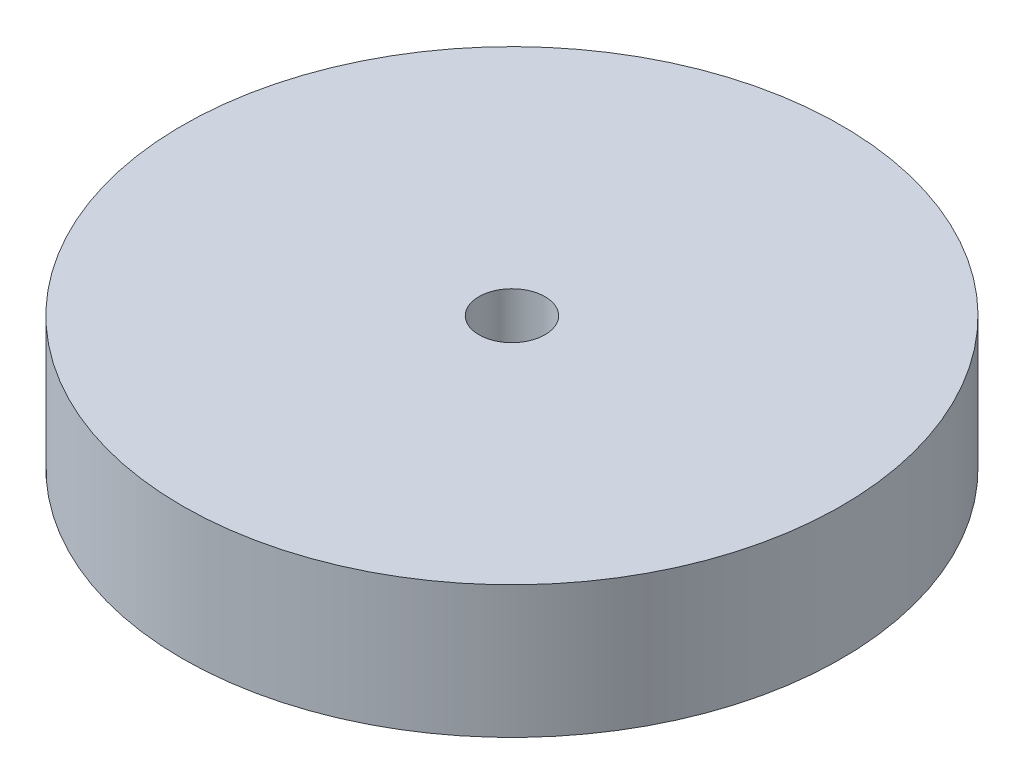
ISO-10303-21;
HEADER;
FILE_DESCRIPTION(('STEP AP214'),'2;1');
FILE_NAME('part.step','',(''),(''),'','','');
FILE_SCHEMA(('AUTOMOTIVE_DESIGN { 1 0 10303 214 1 1 1 1 }'));
ENDSEC;
DATA;
#1=APPLICATION_CONTEXT('core data for automotive mechanical design processes');
#2=APPLICATION_PROTOCOL_DEFINITION('international standard','automotive_design',2000,#1);
#3=PRODUCT_CONTEXT('',#1,'mechanical');
#4=PRODUCT('Part','Part','',(#3));
#5=PRODUCT_RELATED_PRODUCT_CATEGORY('part','',(#4));
#6=PRODUCT_DEFINITION_FORMATION('','',#4);
#7=PRODUCT_DEFINITION_CONTEXT('part definition',#1,'design');
#8=PRODUCT_DEFINITION('design','',#6,#7);
#9=PRODUCT_DEFINITION_SHAPE('','',#8);
#10=(LENGTH_UNIT() NAMED_UNIT(*) SI_UNIT(.MILLI.,.METRE.));
#11=(NAMED_UNIT(*) PLANE_ANGLE_UNIT() SI_UNIT($,.RADIAN.));
#12=(NAMED_UNIT(*) SI_UNIT($,.STERADIAN.) SOLID_ANGLE_UNIT());
#13=UNCERTAINTY_MEASURE_WITH_UNIT(LENGTH_MEASURE(1.E-05),#10,'distance_accuracy_value','');
#14=(GEOMETRIC_REPRESENTATION_CONTEXT(3) GLOBAL_UNCERTAINTY_ASSIGNED_CONTEXT((#13)) GLOBAL_UNIT_ASSIGNED_CONTEXT((#10,
#11,#12)) REPRESENTATION_CONTEXT('',''));
#15=CARTESIAN_POINT('',(0.,0.,0.));
#16=DIRECTION('',(0.,0.,1.));
#17=DIRECTION('',(1.,0.,0.));
#18=AXIS2_PLACEMENT_3D('',#15,#16,#17);
#19=CARTESIAN_POINT('',(0.,5.08,0.));
#20=DIRECTION('',(0.,1.,0.));
#21=DIRECTION('',(0.,0.,1.));
#22=AXIS2_PLACEMENT_3D('',#19,#20,#21);
#23=PLANE('',#22);
#24=CARTESIAN_POINT('',(0.,5.08,0.));
#25=DIRECTION('',(0.,1.,0.));
#26=DIRECTION('',(0.,0.,1.));
#27=AXIS2_PLACEMENT_3D('',#24,#25,#26);
#28=CIRCLE('',#27,12.662852007725);
#29=CARTESIAN_POINT('',(0.,5.08,12.662852007725));
#30=VERTEX_POINT('',#29);
#31=EDGE_CURVE('E10',#30,#30,#28,.T.);
#32=ORIENTED_EDGE('',*,*,#31,.T.);
#33=EDGE_LOOP('',(#32));
#34=FACE_BOUND('',#33,.T.);
#35=CARTESIAN_POINT('',(0.,5.08,0.));
#36=DIRECTION('',(0.,1.,0.));
#37=DIRECTION('',(0.,0.,1.));
#38=AXIS2_PLACEMENT_3D('',#35,#36,#37);
#39=CIRCLE('',#38,1.27);
#40=CARTESIAN_POINT('',(0.,5.08,1.27));
#41=VERTEX_POINT('',#40);
#42=EDGE_CURVE('E50',#41,#41,#39,.T.);
#43=ORIENTED_EDGE('',*,*,#42,.F.);
#44=EDGE_LOOP('',(#43));
#45=FACE_BOUND('',#44,.T.);
#46=ADVANCED_FACE('F37',(#34,#45),#23,.T.);
#47=CARTESIAN_POINT('',(0.,0.,0.));
#48=DIRECTION('',(0.,1.,0.));
#49=DIRECTION('',(0.,0.,1.));
#50=AXIS2_PLACEMENT_3D('',#47,#48,#49);
#51=PLANE('',#50);
#52=CARTESIAN_POINT('',(0.,0.,0.));
#53=DIRECTION('',(0.,1.,0.));
#54=DIRECTION('',(0.,0.,1.));
#55=AXIS2_PLACEMENT_3D('',#52,#53,#54);
#56=CIRCLE('',#55,12.662852007725);
#57=CARTESIAN_POINT('',(0.,0.,12.662852007725));
#58=VERTEX_POINT('',#57);
#59=EDGE_CURVE('E41',#58,#58,#56,.T.);
#60=ORIENTED_EDGE('',*,*,#59,.F.);
#61=EDGE_LOOP('',(#60));
#62=FACE_BOUND('',#61,.T.);
#63=CARTESIAN_POINT('',(0.,0.,0.));
#64=DIRECTION('',(0.,1.,0.));
#65=DIRECTION('',(0.,0.,1.));
#66=AXIS2_PLACEMENT_3D('',#63,#64,#65);
#67=CIRCLE('',#66,1.27);
#68=CARTESIAN_POINT('',(0.,0.,1.27));
#69=VERTEX_POINT('',#68);
#70=EDGE_CURVE('E52',#69,#69,#67,.T.);
#71=ORIENTED_EDGE('',*,*,#70,.T.);
#72=EDGE_LOOP('',(#71));
#73=FACE_BOUND('',#72,.T.);
#74=ADVANCED_FACE('F64',(#62,#73),#51,.F.);
#75=CARTESIAN_POINT('',(0.,5.08,0.));
#76=DIRECTION('',(0.,-1.,0.));
#77=DIRECTION('',(0.,0.,-1.));
#78=AXIS2_PLACEMENT_3D('',#75,#76,#77);
#79=CYLINDRICAL_SURFACE('',#78,12.662852007725);
#80=ORIENTED_EDGE('',*,*,#31,.F.);
#81=EDGE_LOOP('',(#80));
#82=FACE_BOUND('',#81,.T.);
#83=ORIENTED_EDGE('',*,*,#59,.T.);
#84=EDGE_LOOP('',(#83));
#85=FACE_BOUND('',#84,.T.);
#86=ADVANCED_FACE('F39',(#82,#85),#79,.T.);
#87=CARTESIAN_POINT('',(0.,5.08,0.));
#88=DIRECTION('',(0.,-1.,0.));
#89=DIRECTION('',(0.,0.,-1.));
#90=AXIS2_PLACEMENT_3D('',#87,#88,#89);
#91=CYLINDRICAL_SURFACE('',#90,1.27);
#92=ORIENTED_EDGE('',*,*,#42,.T.);
#93=EDGE_LOOP('',(#92));
#94=FACE_BOUND('',#93,.T.);
#95=ORIENTED_EDGE('',*,*,#70,.F.);
#96=EDGE_LOOP('',(#95));
#97=FACE_BOUND('',#96,.T.);
#98=ADVANCED_FACE('F60',(#94,#97),#91,.F.);
#99=CLOSED_SHELL('',(#46,#74,#86,#98));
#100=MANIFOLD_SOLID_BREP('B2',#99);
#101=ADVANCED_BREP_SHAPE_REPRESENTATION('',(#18,#100),#14);
#102=SHAPE_DEFINITION_REPRESENTATION(#9,#101);
ENDSEC;
END-ISO-10303-21;
